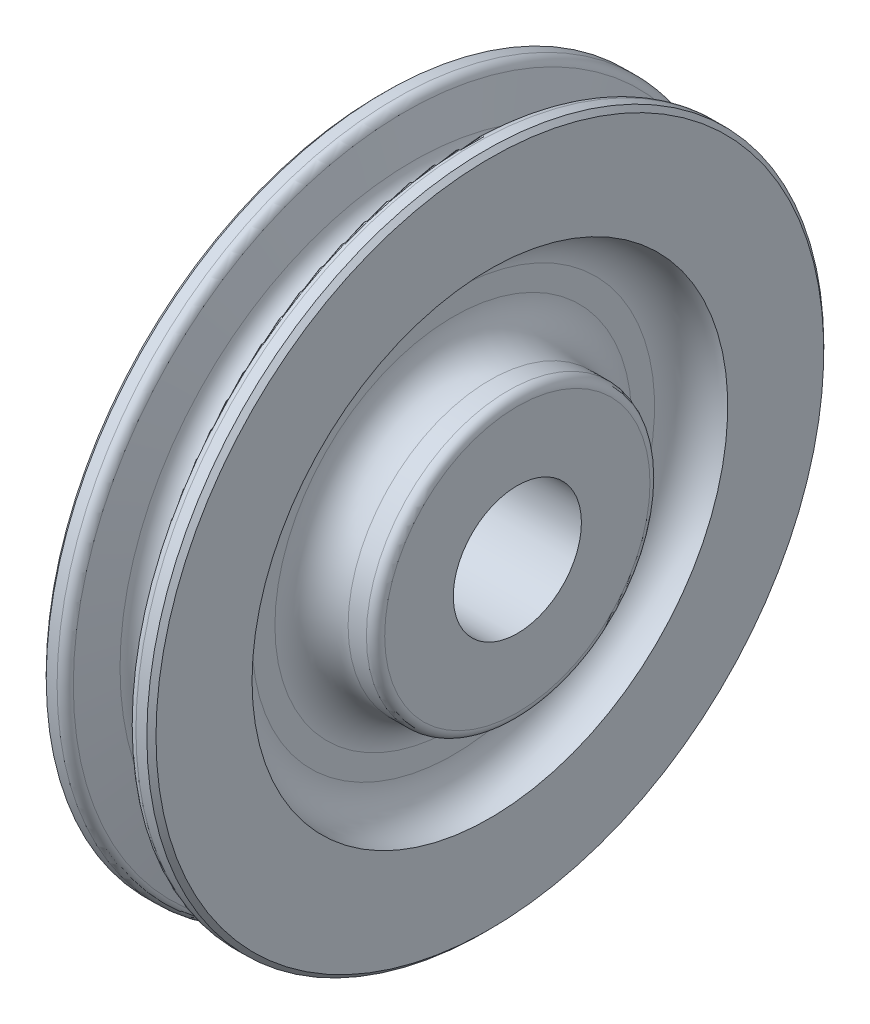
ISO-10303-21;
HEADER;
FILE_DESCRIPTION(('STEP AP214'),'2;1');
FILE_NAME('part.step','',(''),(''),'','','');
FILE_SCHEMA(('AUTOMOTIVE_DESIGN { 1 0 10303 214 1 1 1 1 }'));
ENDSEC;
DATA;
#1=APPLICATION_CONTEXT('core data for automotive mechanical design processes');
#2=APPLICATION_PROTOCOL_DEFINITION('international standard','automotive_design',2000,#1);
#3=PRODUCT_CONTEXT('',#1,'mechanical');
#4=PRODUCT('Part','Part','',(#3));
#5=PRODUCT_RELATED_PRODUCT_CATEGORY('part','',(#4));
#6=PRODUCT_DEFINITION_FORMATION('','',#4);
#7=PRODUCT_DEFINITION_CONTEXT('part definition',#1,'design');
#8=PRODUCT_DEFINITION('design','',#6,#7);
#9=PRODUCT_DEFINITION_SHAPE('','',#8);
#10=(LENGTH_UNIT() NAMED_UNIT(*) SI_UNIT(.MILLI.,.METRE.));
#11=(NAMED_UNIT(*) PLANE_ANGLE_UNIT() SI_UNIT($,.RADIAN.));
#12=(NAMED_UNIT(*) SI_UNIT($,.STERADIAN.) SOLID_ANGLE_UNIT());
#13=UNCERTAINTY_MEASURE_WITH_UNIT(LENGTH_MEASURE(1.E-05),#10,'distance_accuracy_value','');
#14=(GEOMETRIC_REPRESENTATION_CONTEXT(3) GLOBAL_UNCERTAINTY_ASSIGNED_CONTEXT((#13)) GLOBAL_UNIT_ASSIGNED_CONTEXT((#10,
#11,#12)) REPRESENTATION_CONTEXT('',''));
#15=CARTESIAN_POINT('',(0.,0.,0.));
#16=DIRECTION('',(0.,0.,1.));
#17=DIRECTION('',(1.,0.,0.));
#18=AXIS2_PLACEMENT_3D('',#15,#16,#17);
#19=CARTESIAN_POINT('',(0.,0.,0.));
#20=DIRECTION('',(-1.,0.,0.));
#21=DIRECTION('',(0.,0.,1.));
#22=AXIS2_PLACEMENT_3D('',#19,#20,#21);
#23=TOROIDAL_SURFACE('',#22,51.5937500000002,3.96875);
#24=CARTESIAN_POINT('',(-3.88395786670477,0.,0.));
#25=DIRECTION('',(-1.,0.,0.));
#26=DIRECTION('',(0.,0.,1.));
#27=AXIS2_PLACEMENT_3D('',#24,#25,#26);
#28=CIRCLE('',#27,50.7777549925632);
#29=CARTESIAN_POINT('',(-3.88395786670477,0.,50.7777549925632));
#30=VERTEX_POINT('',#29);
#31=EDGE_CURVE('E10',#30,#30,#28,.T.);
#32=ORIENTED_EDGE('',*,*,#31,.F.);
#33=EDGE_LOOP('',(#32));
#34=FACE_BOUND('',#33,.T.);
#35=CARTESIAN_POINT('',(3.88395786670477,0.,0.));
#36=DIRECTION('',(-1.,0.,0.));
#37=DIRECTION('',(0.,0.,1.));
#38=AXIS2_PLACEMENT_3D('',#35,#36,#37);
#39=CIRCLE('',#38,50.7777549925632);
#40=CARTESIAN_POINT('',(3.88395786670477,0.,50.7777549925632));
#41=VERTEX_POINT('',#40);
#42=EDGE_CURVE('E422',#41,#41,#39,.T.);
#43=ORIENTED_EDGE('',*,*,#42,.T.);
#44=EDGE_LOOP('',(#43));
#45=FACE_BOUND('',#44,.T.);
#46=ADVANCED_FACE('F352',(#34,#45),#23,.F.);
#47=CARTESIAN_POINT('',(-3.88395786670477,0.,0.));
#48=DIRECTION('',(-1.,0.,0.));
#49=DIRECTION('',(0.,0.,1.));
#50=AXIS2_PLACEMENT_3D('',#47,#48,#49);
#51=CONICAL_SURFACE('',#50,50.7777549925632,1.36371440951659);
#52=CARTESIAN_POINT('',(-5.2913004385583,0.,0.));
#53=DIRECTION('',(-1.,0.,0.));
#54=DIRECTION('',(0.,0.,1.));
#55=AXIS2_PLACEMENT_3D('',#52,#53,#54);
#56=CIRCLE('',#55,57.476398002975);
#57=CARTESIAN_POINT('',(-5.2913004385583,0.,57.476398002975));
#58=VERTEX_POINT('',#57);
#59=EDGE_CURVE('E358',#58,#58,#56,.T.);
#60=ORIENTED_EDGE('',*,*,#59,.F.);
#61=EDGE_LOOP('',(#60));
#62=FACE_BOUND('',#61,.T.);
#63=ORIENTED_EDGE('',*,*,#31,.T.);
#64=EDGE_LOOP('',(#63));
#65=FACE_BOUND('',#64,.T.);
#66=ADVANCED_FACE('F455',(#62,#65),#51,.T.);
#67=CARTESIAN_POINT('',(-6.84488358524021,0.,0.));
#68=DIRECTION('',(-1.,0.,0.));
#69=DIRECTION('',(0.,0.,1.));
#70=AXIS2_PLACEMENT_3D('',#67,#68,#69);
#71=TOROIDAL_SURFACE('',#70,57.1500000000002,1.5875);
#72=CARTESIAN_POINT('',(-6.84488358524021,0.,0.));
#73=DIRECTION('',(-1.,0.,0.));
#74=DIRECTION('',(0.,0.,1.));
#75=AXIS2_PLACEMENT_3D('',#72,#73,#74);
#76=CIRCLE('',#75,58.7375000000002);
#77=CARTESIAN_POINT('',(-6.84488358524021,0.,58.7375000000002));
#78=VERTEX_POINT('',#77);
#79=EDGE_CURVE('E362',#78,#78,#76,.T.);
#80=ORIENTED_EDGE('',*,*,#79,.F.);
#81=EDGE_LOOP('',(#80));
#82=FACE_BOUND('',#81,.T.);
#83=ORIENTED_EDGE('',*,*,#59,.T.);
#84=EDGE_LOOP('',(#83));
#85=FACE_BOUND('',#84,.T.);
#86=ADVANCED_FACE('F460',(#82,#85),#71,.T.);
#87=CARTESIAN_POINT('',(-14.2875,0.,0.));
#88=DIRECTION('',(-1.,0.,0.));
#89=DIRECTION('',(0.,0.,1.));
#90=AXIS2_PLACEMENT_3D('',#87,#88,#89);
#91=CYLINDRICAL_SURFACE('',#90,58.7375000000002);
#92=CARTESIAN_POINT('',(-8.73125,0.,0.));
#93=DIRECTION('',(-1.,0.,0.));
#94=DIRECTION('',(0.,0.,1.));
#95=AXIS2_PLACEMENT_3D('',#92,#93,#94);
#96=CIRCLE('',#95,58.7375000000002);
#97=CARTESIAN_POINT('',(-8.73125,0.,58.7375000000002));
#98=VERTEX_POINT('',#97);
#99=EDGE_CURVE('E366',#98,#98,#96,.T.);
#100=ORIENTED_EDGE('',*,*,#99,.F.);
#101=EDGE_LOOP('',(#100));
#102=FACE_BOUND('',#101,.T.);
#103=ORIENTED_EDGE('',*,*,#79,.T.);
#104=EDGE_LOOP('',(#103));
#105=FACE_BOUND('',#104,.T.);
#106=ADVANCED_FACE('F564',(#102,#105),#91,.T.);
#107=CARTESIAN_POINT('',(-8.73125,0.,0.));
#108=DIRECTION('',(1.,0.,0.));
#109=DIRECTION('',(0.,0.,-1.));
#110=AXIS2_PLACEMENT_3D('',#107,#108,#109);
#111=CONICAL_SURFACE('',#110,58.7375000000002,0.78539816339744);
#112=CARTESIAN_POINT('',(-9.525,0.,0.));
#113=DIRECTION('',(-1.,0.,0.));
#114=DIRECTION('',(0.,0.,1.));
#115=AXIS2_PLACEMENT_3D('',#112,#113,#114);
#116=CIRCLE('',#115,57.9437500000002);
#117=CARTESIAN_POINT('',(-9.525,0.,57.9437500000002));
#118=VERTEX_POINT('',#117);
#119=EDGE_CURVE('E371',#118,#118,#116,.T.);
#120=ORIENTED_EDGE('',*,*,#119,.F.);
#121=EDGE_LOOP('',(#120));
#122=FACE_BOUND('',#121,.T.);
#123=ORIENTED_EDGE('',*,*,#99,.T.);
#124=EDGE_LOOP('',(#123));
#125=FACE_BOUND('',#124,.T.);
#126=ADVANCED_FACE('F558',(#122,#125),#111,.T.);
#127=CARTESIAN_POINT('',(-9.525,57.9437500000002,0.));
#128=DIRECTION('',(1.,0.,0.));
#129=DIRECTION('',(0.,0.,-1.));
#130=AXIS2_PLACEMENT_3D('',#127,#128,#129);
#131=PLANE('',#130);
#132=CARTESIAN_POINT('',(-9.525,0.,0.));
#133=DIRECTION('',(-1.,0.,0.));
#134=DIRECTION('',(0.,0.,1.));
#135=AXIS2_PLACEMENT_3D('',#132,#133,#134);
#136=CIRCLE('',#135,41.2750000000002);
#137=CARTESIAN_POINT('',(-9.525,0.,41.2750000000002));
#138=VERTEX_POINT('',#137);
#139=EDGE_CURVE('E374',#138,#138,#136,.T.);
#140=ORIENTED_EDGE('',*,*,#139,.F.);
#141=EDGE_LOOP('',(#140));
#142=FACE_BOUND('',#141,.T.);
#143=ORIENTED_EDGE('',*,*,#119,.T.);
#144=EDGE_LOOP('',(#143));
#145=FACE_BOUND('',#144,.T.);
#146=ADVANCED_FACE('F552',(#142,#145),#131,.F.);
#147=CARTESIAN_POINT('',(-9.525,0.,0.));
#148=DIRECTION('',(-1.,0.,0.));
#149=DIRECTION('',(0.,0.,1.));
#150=AXIS2_PLACEMENT_3D('',#147,#148,#149);
#151=TOROIDAL_SURFACE('',#150,34.9250000000002,6.35);
#152=CARTESIAN_POINT('',(-3.175,0.,0.));
#153=DIRECTION('',(-1.,0.,0.));
#154=DIRECTION('',(0.,0.,1.));
#155=AXIS2_PLACEMENT_3D('',#152,#153,#154);
#156=CIRCLE('',#155,34.9250000000002);
#157=CARTESIAN_POINT('',(-3.175,0.,34.9250000000002));
#158=VERTEX_POINT('',#157);
#159=EDGE_CURVE('E377',#158,#158,#156,.T.);
#160=ORIENTED_EDGE('',*,*,#159,.F.);
#161=EDGE_LOOP('',(#160));
#162=FACE_BOUND('',#161,.T.);
#163=ORIENTED_EDGE('',*,*,#139,.T.);
#164=EDGE_LOOP('',(#163));
#165=FACE_BOUND('',#164,.T.);
#166=ADVANCED_FACE('F546',(#162,#165),#151,.F.);
#167=CARTESIAN_POINT('',(-3.175,34.9250000000002,0.));
#168=DIRECTION('',(1.,0.,0.));
#169=DIRECTION('',(0.,0.,-1.));
#170=AXIS2_PLACEMENT_3D('',#167,#168,#169);
#171=PLANE('',#170);
#172=CARTESIAN_POINT('',(-3.175,0.,0.));
#173=DIRECTION('',(-1.,0.,0.));
#174=DIRECTION('',(0.,0.,1.));
#175=AXIS2_PLACEMENT_3D('',#172,#173,#174);
#176=CIRCLE('',#175,30.9562500000002);
#177=CARTESIAN_POINT('',(-3.175,0.,30.9562500000002));
#178=VERTEX_POINT('',#177);
#179=EDGE_CURVE('E380',#178,#178,#176,.T.);
#180=ORIENTED_EDGE('',*,*,#179,.F.);
#181=EDGE_LOOP('',(#180));
#182=FACE_BOUND('',#181,.T.);
#183=ORIENTED_EDGE('',*,*,#159,.T.);
#184=EDGE_LOOP('',(#183));
#185=FACE_BOUND('',#184,.T.);
#186=ADVANCED_FACE('F540',(#182,#185),#171,.F.);
#187=CARTESIAN_POINT('',(-9.525,0.,0.));
#188=DIRECTION('',(-1.,0.,0.));
#189=DIRECTION('',(0.,0.,1.));
#190=AXIS2_PLACEMENT_3D('',#187,#188,#189);
#191=TOROIDAL_SURFACE('',#190,30.9562500000002,6.35);
#192=CARTESIAN_POINT('',(-9.525,0.,0.));
#193=DIRECTION('',(-1.,0.,0.));
#194=DIRECTION('',(0.,0.,1.));
#195=AXIS2_PLACEMENT_3D('',#192,#193,#194);
#196=CIRCLE('',#195,24.6062500000002);
#197=CARTESIAN_POINT('',(-9.525,0.,24.6062500000002));
#198=VERTEX_POINT('',#197);
#199=EDGE_CURVE('E383',#198,#198,#196,.T.);
#200=ORIENTED_EDGE('',*,*,#199,.F.);
#201=EDGE_LOOP('',(#200));
#202=FACE_BOUND('',#201,.T.);
#203=ORIENTED_EDGE('',*,*,#179,.T.);
#204=EDGE_LOOP('',(#203));
#205=FACE_BOUND('',#204,.T.);
#206=ADVANCED_FACE('F534',(#202,#205),#191,.F.);
#207=CARTESIAN_POINT('',(-14.2875,0.,0.));
#208=DIRECTION('',(-1.,0.,0.));
#209=DIRECTION('',(0.,0.,1.));
#210=AXIS2_PLACEMENT_3D('',#207,#208,#209);
#211=CYLINDRICAL_SURFACE('',#210,24.6062500000001);
#212=CARTESIAN_POINT('',(-12.7000000000001,0.,0.));
#213=DIRECTION('',(-1.,0.,0.));
#214=DIRECTION('',(0.,0.,1.));
#215=AXIS2_PLACEMENT_3D('',#212,#213,#214);
#216=CIRCLE('',#215,24.6062499999999);
#217=CARTESIAN_POINT('',(-12.7000000000001,0.,24.6062499999999));
#218=VERTEX_POINT('',#217);
#219=EDGE_CURVE('E386',#218,#218,#216,.T.);
#220=ORIENTED_EDGE('',*,*,#219,.F.);
#221=EDGE_LOOP('',(#220));
#222=FACE_BOUND('',#221,.T.);
#223=ORIENTED_EDGE('',*,*,#199,.T.);
#224=EDGE_LOOP('',(#223));
#225=FACE_BOUND('',#224,.T.);
#226=ADVANCED_FACE('F528',(#222,#225),#211,.T.);
#227=CARTESIAN_POINT('',(-12.7,0.,0.));
#228=DIRECTION('',(-1.,0.,0.));
#229=DIRECTION('',(0.,0.,1.));
#230=AXIS2_PLACEMENT_3D('',#227,#228,#229);
#231=TOROIDAL_SURFACE('',#230,23.0187499999999,1.5875);
#232=CARTESIAN_POINT('',(-14.2875,0.,0.));
#233=DIRECTION('',(-1.,0.,0.));
#234=DIRECTION('',(0.,0.,1.));
#235=AXIS2_PLACEMENT_3D('',#232,#233,#234);
#236=CIRCLE('',#235,23.0187499999999);
#237=CARTESIAN_POINT('',(-14.2875,0.,23.0187499999999));
#238=VERTEX_POINT('',#237);
#239=EDGE_CURVE('E389',#238,#238,#236,.T.);
#240=ORIENTED_EDGE('',*,*,#239,.F.);
#241=EDGE_LOOP('',(#240));
#242=FACE_BOUND('',#241,.T.);
#243=ORIENTED_EDGE('',*,*,#219,.T.);
#244=EDGE_LOOP('',(#243));
#245=FACE_BOUND('',#244,.T.);
#246=ADVANCED_FACE('F523',(#242,#245),#231,.T.);
#247=CARTESIAN_POINT('',(-14.2875,23.0187499999999,0.));
#248=DIRECTION('',(1.,0.,0.));
#249=DIRECTION('',(0.,0.,-1.));
#250=AXIS2_PLACEMENT_3D('',#247,#248,#249);
#251=PLANE('',#250);
#252=CARTESIAN_POINT('',(-14.2875,0.,0.));
#253=DIRECTION('',(1.,0.,0.));
#254=DIRECTION('',(0.,0.,-1.));
#255=AXIS2_PLACEMENT_3D('',#252,#253,#254);
#256=CIRCLE('',#255,11.11885);
#257=CARTESIAN_POINT('',(-14.2875,0.,-11.11885));
#258=VERTEX_POINT('',#257);
#259=EDGE_CURVE('E425',#258,#258,#256,.T.);
#260=ORIENTED_EDGE('',*,*,#259,.T.);
#261=EDGE_LOOP('',(#260));
#262=FACE_BOUND('',#261,.T.);
#263=ORIENTED_EDGE('',*,*,#239,.T.);
#264=EDGE_LOOP('',(#263));
#265=FACE_BOUND('',#264,.T.);
#266=ADVANCED_FACE('F438',(#262,#265),#251,.F.);
#267=CARTESIAN_POINT('',(14.2875,23.0187499999999,0.));
#268=DIRECTION('',(-1.,0.,0.));
#269=DIRECTION('',(0.,0.,1.));
#270=AXIS2_PLACEMENT_3D('',#267,#268,#269);
#271=PLANE('',#270);
#272=CARTESIAN_POINT('',(14.2875,0.,0.));
#273=DIRECTION('',(1.,0.,0.));
#274=DIRECTION('',(0.,0.,-1.));
#275=AXIS2_PLACEMENT_3D('',#272,#273,#274);
#276=CIRCLE('',#275,11.11885);
#277=CARTESIAN_POINT('',(14.2875,0.,-11.11885));
#278=VERTEX_POINT('',#277);
#279=EDGE_CURVE('E428',#278,#278,#276,.T.);
#280=ORIENTED_EDGE('',*,*,#279,.F.);
#281=EDGE_LOOP('',(#280));
#282=FACE_BOUND('',#281,.T.);
#283=CARTESIAN_POINT('',(14.2875,0.,0.));
#284=DIRECTION('',(-1.,0.,0.));
#285=DIRECTION('',(0.,0.,1.));
#286=AXIS2_PLACEMENT_3D('',#283,#284,#285);
#287=CIRCLE('',#286,23.0187499999999);
#288=CARTESIAN_POINT('',(14.2875,0.,23.0187499999999));
#289=VERTEX_POINT('',#288);
#290=EDGE_CURVE('E392',#289,#289,#287,.T.);
#291=ORIENTED_EDGE('',*,*,#290,.F.);
#292=EDGE_LOOP('',(#291));
#293=FACE_BOUND('',#292,.T.);
#294=ADVANCED_FACE('F434',(#282,#293),#271,.F.);
#295=CARTESIAN_POINT('',(12.7,0.,0.));
#296=DIRECTION('',(-1.,0.,0.));
#297=DIRECTION('',(0.,0.,1.));
#298=AXIS2_PLACEMENT_3D('',#295,#296,#297);
#299=TOROIDAL_SURFACE('',#298,23.0187499999999,1.5875);
#300=CARTESIAN_POINT('',(12.7000000000001,0.,0.));
#301=DIRECTION('',(-1.,0.,0.));
#302=DIRECTION('',(0.,0.,1.));
#303=AXIS2_PLACEMENT_3D('',#300,#301,#302);
#304=CIRCLE('',#303,24.6062499999999);
#305=CARTESIAN_POINT('',(12.7000000000001,0.,24.6062499999999));
#306=VERTEX_POINT('',#305);
#307=EDGE_CURVE('E395',#306,#306,#304,.T.);
#308=ORIENTED_EDGE('',*,*,#307,.F.);
#309=EDGE_LOOP('',(#308));
#310=FACE_BOUND('',#309,.T.);
#311=ORIENTED_EDGE('',*,*,#290,.T.);
#312=EDGE_LOOP('',(#311));
#313=FACE_BOUND('',#312,.T.);
#314=ADVANCED_FACE('F437',(#310,#313),#299,.T.);
#315=CARTESIAN_POINT('',(-14.2875,0.,0.));
#316=DIRECTION('',(-1.,0.,0.));
#317=DIRECTION('',(0.,0.,1.));
#318=AXIS2_PLACEMENT_3D('',#315,#316,#317);
#319=CYLINDRICAL_SURFACE('',#318,24.6062500000001);
#320=CARTESIAN_POINT('',(9.525,0.,0.));
#321=DIRECTION('',(-1.,0.,0.));
#322=DIRECTION('',(0.,0.,1.));
#323=AXIS2_PLACEMENT_3D('',#320,#321,#322);
#324=CIRCLE('',#323,24.6062500000002);
#325=CARTESIAN_POINT('',(9.525,0.,24.6062500000002));
#326=VERTEX_POINT('',#325);
#327=EDGE_CURVE('E398',#326,#326,#324,.T.);
#328=ORIENTED_EDGE('',*,*,#327,.F.);
#329=EDGE_LOOP('',(#328));
#330=FACE_BOUND('',#329,.T.);
#331=ORIENTED_EDGE('',*,*,#307,.T.);
#332=EDGE_LOOP('',(#331));
#333=FACE_BOUND('',#332,.T.);
#334=ADVANCED_FACE('F443',(#330,#333),#319,.T.);
#335=CARTESIAN_POINT('',(9.525,0.,0.));
#336=DIRECTION('',(-1.,0.,0.));
#337=DIRECTION('',(0.,0.,1.));
#338=AXIS2_PLACEMENT_3D('',#335,#336,#337);
#339=TOROIDAL_SURFACE('',#338,30.9562500000002,6.35);
#340=CARTESIAN_POINT('',(3.175,0.,0.));
#341=DIRECTION('',(-1.,0.,0.));
#342=DIRECTION('',(0.,0.,1.));
#343=AXIS2_PLACEMENT_3D('',#340,#341,#342);
#344=CIRCLE('',#343,30.9562500000002);
#345=CARTESIAN_POINT('',(3.175,0.,30.9562500000002));
#346=VERTEX_POINT('',#345);
#347=EDGE_CURVE('E401',#346,#346,#344,.T.);
#348=ORIENTED_EDGE('',*,*,#347,.F.);
#349=EDGE_LOOP('',(#348));
#350=FACE_BOUND('',#349,.T.);
#351=ORIENTED_EDGE('',*,*,#327,.T.);
#352=EDGE_LOOP('',(#351));
#353=FACE_BOUND('',#352,.T.);
#354=ADVANCED_FACE('F450',(#350,#353),#339,.F.);
#355=CARTESIAN_POINT('',(3.17500000000001,34.9249999999998,0.));
#356=DIRECTION('',(-1.,0.,0.));
#357=DIRECTION('',(0.,0.,1.));
#358=AXIS2_PLACEMENT_3D('',#355,#356,#357);
#359=PLANE('',#358);
#360=CARTESIAN_POINT('',(3.17500000000001,0.,0.));
#361=DIRECTION('',(-1.,0.,0.));
#362=DIRECTION('',(0.,0.,1.));
#363=AXIS2_PLACEMENT_3D('',#360,#361,#362);
#364=CIRCLE('',#363,34.9249999999998);
#365=CARTESIAN_POINT('',(3.17500000000001,0.,34.9249999999998));
#366=VERTEX_POINT('',#365);
#367=EDGE_CURVE('E404',#366,#366,#364,.T.);
#368=ORIENTED_EDGE('',*,*,#367,.F.);
#369=EDGE_LOOP('',(#368));
#370=FACE_BOUND('',#369,.T.);
#371=ORIENTED_EDGE('',*,*,#347,.T.);
#372=EDGE_LOOP('',(#371));
#373=FACE_BOUND('',#372,.T.);
#374=ADVANCED_FACE('F498',(#370,#373),#359,.F.);
#375=CARTESIAN_POINT('',(9.525,0.,0.));
#376=DIRECTION('',(-1.,0.,0.));
#377=DIRECTION('',(0.,0.,1.));
#378=AXIS2_PLACEMENT_3D('',#375,#376,#377);
#379=TOROIDAL_SURFACE('',#378,34.9249999999998,6.34999999999999);
#380=CARTESIAN_POINT('',(9.525,0.,0.));
#381=DIRECTION('',(-1.,0.,0.));
#382=DIRECTION('',(0.,0.,1.));
#383=AXIS2_PLACEMENT_3D('',#380,#381,#382);
#384=CIRCLE('',#383,41.2749999999998);
#385=CARTESIAN_POINT('',(9.525,0.,41.2749999999998));
#386=VERTEX_POINT('',#385);
#387=EDGE_CURVE('E407',#386,#386,#384,.T.);
#388=ORIENTED_EDGE('',*,*,#387,.F.);
#389=EDGE_LOOP('',(#388));
#390=FACE_BOUND('',#389,.T.);
#391=ORIENTED_EDGE('',*,*,#367,.T.);
#392=EDGE_LOOP('',(#391));
#393=FACE_BOUND('',#392,.T.);
#394=ADVANCED_FACE('F492',(#390,#393),#379,.F.);
#395=CARTESIAN_POINT('',(9.525,57.9437500000002,0.));
#396=DIRECTION('',(-1.,0.,0.));
#397=DIRECTION('',(0.,0.,1.));
#398=AXIS2_PLACEMENT_3D('',#395,#396,#397);
#399=PLANE('',#398);
#400=CARTESIAN_POINT('',(9.525,0.,0.));
#401=DIRECTION('',(-1.,0.,0.));
#402=DIRECTION('',(0.,0.,1.));
#403=AXIS2_PLACEMENT_3D('',#400,#401,#402);
#404=CIRCLE('',#403,57.9437500000002);
#405=CARTESIAN_POINT('',(9.525,0.,57.9437500000002));
#406=VERTEX_POINT('',#405);
#407=EDGE_CURVE('E410',#406,#406,#404,.T.);
#408=ORIENTED_EDGE('',*,*,#407,.F.);
#409=EDGE_LOOP('',(#408));
#410=FACE_BOUND('',#409,.T.);
#411=ORIENTED_EDGE('',*,*,#387,.T.);
#412=EDGE_LOOP('',(#411));
#413=FACE_BOUND('',#412,.T.);
#414=ADVANCED_FACE('F486',(#410,#413),#399,.F.);
#415=CARTESIAN_POINT('',(9.525,0.,0.));
#416=DIRECTION('',(-1.,0.,0.));
#417=DIRECTION('',(0.,0.,1.));
#418=AXIS2_PLACEMENT_3D('',#415,#416,#417);
#419=CONICAL_SURFACE('',#418,57.9437500000002,0.78539816339744);
#420=CARTESIAN_POINT('',(8.73125,0.,0.));
#421=DIRECTION('',(-1.,0.,0.));
#422=DIRECTION('',(0.,0.,1.));
#423=AXIS2_PLACEMENT_3D('',#420,#421,#422);
#424=CIRCLE('',#423,58.7375000000002);
#425=CARTESIAN_POINT('',(8.73125,0.,58.7375000000002));
#426=VERTEX_POINT('',#425);
#427=EDGE_CURVE('E413',#426,#426,#424,.T.);
#428=ORIENTED_EDGE('',*,*,#427,.F.);
#429=EDGE_LOOP('',(#428));
#430=FACE_BOUND('',#429,.T.);
#431=ORIENTED_EDGE('',*,*,#407,.T.);
#432=EDGE_LOOP('',(#431));
#433=FACE_BOUND('',#432,.T.);
#434=ADVANCED_FACE('F480',(#430,#433),#419,.T.);
#435=CARTESIAN_POINT('',(-14.2875,0.,0.));
#436=DIRECTION('',(-1.,0.,0.));
#437=DIRECTION('',(0.,0.,1.));
#438=AXIS2_PLACEMENT_3D('',#435,#436,#437);
#439=CYLINDRICAL_SURFACE('',#438,58.7375000000002);
#440=CARTESIAN_POINT('',(6.84488358524021,0.,0.));
#441=DIRECTION('',(-1.,0.,0.));
#442=DIRECTION('',(0.,0.,1.));
#443=AXIS2_PLACEMENT_3D('',#440,#441,#442);
#444=CIRCLE('',#443,58.7375000000002);
#445=CARTESIAN_POINT('',(6.84488358524021,0.,58.7375000000002));
#446=VERTEX_POINT('',#445);
#447=EDGE_CURVE('E416',#446,#446,#444,.T.);
#448=ORIENTED_EDGE('',*,*,#447,.F.);
#449=EDGE_LOOP('',(#448));
#450=FACE_BOUND('',#449,.T.);
#451=ORIENTED_EDGE('',*,*,#427,.T.);
#452=EDGE_LOOP('',(#451));
#453=FACE_BOUND('',#452,.T.);
#454=ADVANCED_FACE('F474',(#450,#453),#439,.T.);
#455=CARTESIAN_POINT('',(6.84488358524021,0.,0.));
#456=DIRECTION('',(-1.,0.,0.));
#457=DIRECTION('',(0.,0.,1.));
#458=AXIS2_PLACEMENT_3D('',#455,#456,#457);
#459=TOROIDAL_SURFACE('',#458,57.1500000000002,1.5875);
#460=CARTESIAN_POINT('',(5.2913004385583,0.,0.));
#461=DIRECTION('',(-1.,0.,0.));
#462=DIRECTION('',(0.,0.,1.));
#463=AXIS2_PLACEMENT_3D('',#460,#461,#462);
#464=CIRCLE('',#463,57.476398002975);
#465=CARTESIAN_POINT('',(5.2913004385583,0.,57.476398002975));
#466=VERTEX_POINT('',#465);
#467=EDGE_CURVE('E419',#466,#466,#464,.T.);
#468=ORIENTED_EDGE('',*,*,#467,.F.);
#469=EDGE_LOOP('',(#468));
#470=FACE_BOUND('',#469,.T.);
#471=ORIENTED_EDGE('',*,*,#447,.T.);
#472=EDGE_LOOP('',(#471));
#473=FACE_BOUND('',#472,.T.);
#474=ADVANCED_FACE('F468',(#470,#473),#459,.T.);
#475=CARTESIAN_POINT('',(5.2913004385583,0.,0.));
#476=DIRECTION('',(1.,0.,0.));
#477=DIRECTION('',(0.,0.,-1.));
#478=AXIS2_PLACEMENT_3D('',#475,#476,#477);
#479=CONICAL_SURFACE('',#478,57.476398002975,1.36371440951659);
#480=ORIENTED_EDGE('',*,*,#42,.F.);
#481=EDGE_LOOP('',(#480));
#482=FACE_BOUND('',#481,.T.);
#483=ORIENTED_EDGE('',*,*,#467,.T.);
#484=EDGE_LOOP('',(#483));
#485=FACE_BOUND('',#484,.T.);
#486=ADVANCED_FACE('F465',(#482,#485),#479,.T.);
#487=CARTESIAN_POINT('',(-14.2875,0.,0.));
#488=DIRECTION('',(1.,0.,0.));
#489=DIRECTION('',(0.,0.,-1.));
#490=AXIS2_PLACEMENT_3D('',#487,#488,#489);
#491=CYLINDRICAL_SURFACE('',#490,11.11885);
#492=ORIENTED_EDGE('',*,*,#259,.F.);
#493=EDGE_LOOP('',(#492));
#494=FACE_BOUND('',#493,.T.);
#495=ORIENTED_EDGE('',*,*,#279,.T.);
#496=EDGE_LOOP('',(#495));
#497=FACE_BOUND('',#496,.T.);
#498=ADVANCED_FACE('F432',(#494,#497),#491,.F.);
#499=CLOSED_SHELL('',(#46,#66,#86,#106,#126,#146,#166,#186,#206,#226,#246,#266,#294,#314,#334,
#354,#374,#394,#414,#434,#454,#474,#486,#498));
#500=MANIFOLD_SOLID_BREP('B2',#499);
#501=ADVANCED_BREP_SHAPE_REPRESENTATION('',(#18,#500),#14);
#502=SHAPE_DEFINITION_REPRESENTATION(#9,#501);
ENDSEC;
END-ISO-10303-21;
